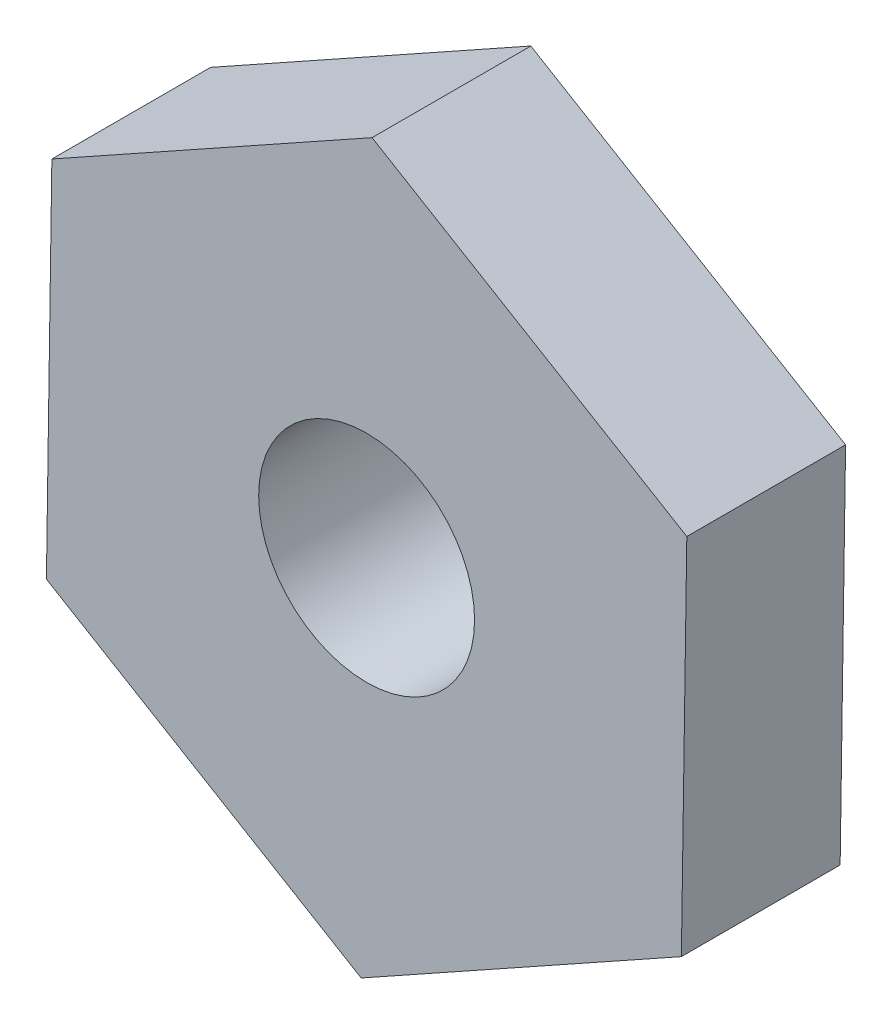
ISO-10303-21;
HEADER;
FILE_DESCRIPTION(('STEP AP214'),'2;1');
FILE_NAME('part.step','',(''),(''),'','','');
FILE_SCHEMA(('AUTOMOTIVE_DESIGN { 1 0 10303 214 1 1 1 1 }'));
ENDSEC;
DATA;
#1=APPLICATION_CONTEXT('core data for automotive mechanical design processes');
#2=APPLICATION_PROTOCOL_DEFINITION('international standard','automotive_design',2000,#1);
#3=PRODUCT_CONTEXT('',#1,'mechanical');
#4=PRODUCT('Part','Part','',(#3));
#5=PRODUCT_RELATED_PRODUCT_CATEGORY('part','',(#4));
#6=PRODUCT_DEFINITION_FORMATION('','',#4);
#7=PRODUCT_DEFINITION_CONTEXT('part definition',#1,'design');
#8=PRODUCT_DEFINITION('design','',#6,#7);
#9=PRODUCT_DEFINITION_SHAPE('','',#8);
#10=(LENGTH_UNIT() NAMED_UNIT(*) SI_UNIT(.MILLI.,.METRE.));
#11=(NAMED_UNIT(*) PLANE_ANGLE_UNIT() SI_UNIT($,.RADIAN.));
#12=(NAMED_UNIT(*) SI_UNIT($,.STERADIAN.) SOLID_ANGLE_UNIT());
#13=UNCERTAINTY_MEASURE_WITH_UNIT(LENGTH_MEASURE(1.E-05),#10,'distance_accuracy_value','');
#14=(GEOMETRIC_REPRESENTATION_CONTEXT(3) GLOBAL_UNCERTAINTY_ASSIGNED_CONTEXT((#13)) GLOBAL_UNIT_ASSIGNED_CONTEXT((#10,
#11,#12)) REPRESENTATION_CONTEXT('',''));
#15=CARTESIAN_POINT('',(0.,0.,0.));
#16=DIRECTION('',(0.,0.,1.));
#17=DIRECTION('',(1.,0.,0.));
#18=AXIS2_PLACEMENT_3D('',#15,#16,#17);
#19=CARTESIAN_POINT('',(-0.171277687011829,-11.5457350258554,5.));
#20=DIRECTION('',(-0.487099165361843,0.873346668341842,0.));
#21=DIRECTION('',(-0.873346668341842,-0.487099165361843,0.));
#22=AXIS2_PLACEMENT_3D('',#19,#20,#21);
#23=PLANE('',#22);
#24=DIRECTION('',(0.873346668341842,0.487099165361843,0.));
#25=VECTOR('',#24,1.);
#26=CARTESIAN_POINT('',(-0.171277687011829,-11.5457350258554,0.));
#27=LINE('',#26,#25);
#28=CARTESIAN_POINT('',(-0.171277687011829,-11.5457350258554,0.));
#29=VERTEX_POINT('',#28);
#30=CARTESIAN_POINT('',(9.91326099424868,-5.9211983409814,0.));
#31=VERTEX_POINT('',#30);
#32=EDGE_CURVE('E119',#29,#31,#27,.T.);
#33=ORIENTED_EDGE('',*,*,#32,.T.);
#34=DIRECTION('',(0.,0.,-1.));
#35=VECTOR('',#34,1.);
#36=CARTESIAN_POINT('',(9.91326099424868,-5.9211983409814,5.));
#37=LINE('',#36,#35);
#38=CARTESIAN_POINT('',(9.91326099424868,-5.9211983409814,5.));
#39=VERTEX_POINT('',#38);
#40=EDGE_CURVE('E11',#39,#31,#37,.T.);
#41=ORIENTED_EDGE('',*,*,#40,.F.);
#42=DIRECTION('',(0.873346668341842,0.487099165361843,0.));
#43=VECTOR('',#42,1.);
#44=CARTESIAN_POINT('',(-0.171277687011829,-11.5457350258554,5.));
#45=LINE('',#44,#43);
#46=CARTESIAN_POINT('',(-0.171277687011829,-11.5457350258554,5.));
#47=VERTEX_POINT('',#46);
#48=EDGE_CURVE('E130',#47,#39,#45,.T.);
#49=ORIENTED_EDGE('',*,*,#48,.F.);
#50=DIRECTION('',(0.,0.,-1.));
#51=VECTOR('',#50,1.);
#52=CARTESIAN_POINT('',(-0.171277687011829,-11.5457350258554,5.));
#53=LINE('',#52,#51);
#54=EDGE_CURVE('E115',#47,#29,#53,.T.);
#55=ORIENTED_EDGE('',*,*,#54,.T.);
#56=EDGE_LOOP('',(#33,#41,#49,#55));
#57=FACE_BOUND('',#56,.T.);
#58=ADVANCED_FACE('F35',(#57),#23,.F.);
#59=CARTESIAN_POINT('',(9.91326099424868,-5.9211983409814,5.));
#60=DIRECTION('',(-0.99988998377546,0.0148330828053681,0.));
#61=DIRECTION('',(-0.0148330828053681,-0.99988998377546,0.));
#62=AXIS2_PLACEMENT_3D('',#59,#60,#61);
#63=PLANE('',#62);
#64=DIRECTION('',(0.0148330828053681,0.99988998377546,0.));
#65=VECTOR('',#64,1.);
#66=CARTESIAN_POINT('',(9.91326099424868,-5.9211983409814,0.));
#67=LINE('',#66,#65);
#68=CARTESIAN_POINT('',(10.0845386812605,5.62453668487404,0.));
#69=VERTEX_POINT('',#68);
#70=EDGE_CURVE('E122',#31,#69,#67,.T.);
#71=ORIENTED_EDGE('',*,*,#70,.T.);
#72=DIRECTION('',(0.,0.,-1.));
#73=VECTOR('',#72,1.);
#74=CARTESIAN_POINT('',(10.0845386812605,5.62453668487404,5.));
#75=LINE('',#74,#73);
#76=CARTESIAN_POINT('',(10.0845386812605,5.62453668487404,5.));
#77=VERTEX_POINT('',#76);
#78=EDGE_CURVE('E43',#77,#69,#75,.T.);
#79=ORIENTED_EDGE('',*,*,#78,.F.);
#80=DIRECTION('',(0.0148330828053681,0.99988998377546,0.));
#81=VECTOR('',#80,1.);
#82=CARTESIAN_POINT('',(9.91326099424868,-5.9211983409814,5.));
#83=LINE('',#82,#81);
#84=EDGE_CURVE('E88',#39,#77,#83,.T.);
#85=ORIENTED_EDGE('',*,*,#84,.F.);
#86=ORIENTED_EDGE('',*,*,#40,.T.);
#87=EDGE_LOOP('',(#71,#79,#85,#86));
#88=FACE_BOUND('',#87,.T.);
#89=ADVANCED_FACE('F155',(#88),#63,.F.);
#90=CARTESIAN_POINT('',(10.0845386812605,5.62453668487404,5.));
#91=DIRECTION('',(-0.512790818413617,-0.858513585536474,0.));
#92=DIRECTION('',(0.858513585536474,-0.512790818413617,0.));
#93=AXIS2_PLACEMENT_3D('',#90,#91,#92);
#94=PLANE('',#93);
#95=DIRECTION('',(-0.858513585536474,0.512790818413617,0.));
#96=VECTOR('',#95,1.);
#97=CARTESIAN_POINT('',(10.0845386812605,5.62453668487404,0.));
#98=LINE('',#97,#96);
#99=CARTESIAN_POINT('',(0.17127768701183,11.5457350258554,0.));
#100=VERTEX_POINT('',#99);
#101=EDGE_CURVE('E125',#69,#100,#98,.T.);
#102=ORIENTED_EDGE('',*,*,#101,.T.);
#103=DIRECTION('',(0.,0.,-1.));
#104=VECTOR('',#103,1.);
#105=CARTESIAN_POINT('',(0.17127768701183,11.5457350258554,5.));
#106=LINE('',#105,#104);
#107=CARTESIAN_POINT('',(0.17127768701183,11.5457350258554,5.));
#108=VERTEX_POINT('',#107);
#109=EDGE_CURVE('E110',#108,#100,#106,.T.);
#110=ORIENTED_EDGE('',*,*,#109,.F.);
#111=DIRECTION('',(-0.858513585536474,0.512790818413617,0.));
#112=VECTOR('',#111,1.);
#113=CARTESIAN_POINT('',(10.0845386812605,5.62453668487404,5.));
#114=LINE('',#113,#112);
#115=EDGE_CURVE('E101',#77,#108,#114,.T.);
#116=ORIENTED_EDGE('',*,*,#115,.F.);
#117=ORIENTED_EDGE('',*,*,#78,.T.);
#118=EDGE_LOOP('',(#102,#110,#116,#117));
#119=FACE_BOUND('',#118,.T.);
#120=ADVANCED_FACE('F136',(#119),#94,.F.);
#121=CARTESIAN_POINT('',(0.17127768701183,11.5457350258554,5.));
#122=DIRECTION('',(0.487099165361843,-0.873346668341842,0.));
#123=DIRECTION('',(0.873346668341843,0.487099165361843,0.));
#124=AXIS2_PLACEMENT_3D('',#121,#122,#123);
#125=PLANE('',#124);
#126=DIRECTION('',(-0.873346668341842,-0.487099165361843,0.));
#127=VECTOR('',#126,1.);
#128=CARTESIAN_POINT('',(0.17127768701183,11.5457350258554,0.));
#129=LINE('',#128,#127);
#130=CARTESIAN_POINT('',(-9.91326099424868,5.9211983409814,0.));
#131=VERTEX_POINT('',#130);
#132=EDGE_CURVE('E109',#100,#131,#129,.T.);
#133=ORIENTED_EDGE('',*,*,#132,.T.);
#134=DIRECTION('',(0.,0.,-1.));
#135=VECTOR('',#134,1.);
#136=CARTESIAN_POINT('',(-9.91326099424868,5.9211983409814,5.));
#137=LINE('',#136,#135);
#138=CARTESIAN_POINT('',(-9.91326099424868,5.9211983409814,5.));
#139=VERTEX_POINT('',#138);
#140=EDGE_CURVE('E106',#139,#131,#137,.T.);
#141=ORIENTED_EDGE('',*,*,#140,.F.);
#142=DIRECTION('',(-0.873346668341842,-0.487099165361843,0.));
#143=VECTOR('',#142,1.);
#144=CARTESIAN_POINT('',(0.17127768701183,11.5457350258554,5.));
#145=LINE('',#144,#143);
#146=EDGE_CURVE('E95',#108,#139,#145,.T.);
#147=ORIENTED_EDGE('',*,*,#146,.F.);
#148=ORIENTED_EDGE('',*,*,#109,.T.);
#149=EDGE_LOOP('',(#133,#141,#147,#148));
#150=FACE_BOUND('',#149,.T.);
#151=ADVANCED_FACE('F107',(#150),#125,.F.);
#152=CARTESIAN_POINT('',(-9.91326099424868,5.9211983409814,5.));
#153=DIRECTION('',(0.99988998377546,-0.0148330828053684,0.));
#154=DIRECTION('',(0.0148330828053684,0.99988998377546,0.));
#155=AXIS2_PLACEMENT_3D('',#152,#153,#154);
#156=PLANE('',#155);
#157=DIRECTION('',(-0.0148330828053684,-0.99988998377546,0.));
#158=VECTOR('',#157,1.);
#159=CARTESIAN_POINT('',(-9.91326099424868,5.9211983409814,0.));
#160=LINE('',#159,#158);
#161=CARTESIAN_POINT('',(-10.0845386812605,-5.62453668487404,0.));
#162=VERTEX_POINT('',#161);
#163=EDGE_CURVE('E74',#131,#162,#160,.T.);
#164=ORIENTED_EDGE('',*,*,#163,.T.);
#165=DIRECTION('',(0.,0.,-1.));
#166=VECTOR('',#165,1.);
#167=CARTESIAN_POINT('',(-10.0845386812605,-5.62453668487404,5.));
#168=LINE('',#167,#166);
#169=CARTESIAN_POINT('',(-10.0845386812605,-5.62453668487404,5.));
#170=VERTEX_POINT('',#169);
#171=EDGE_CURVE('E111',#170,#162,#168,.T.);
#172=ORIENTED_EDGE('',*,*,#171,.F.);
#173=DIRECTION('',(-0.0148330828053684,-0.99988998377546,0.));
#174=VECTOR('',#173,1.);
#175=CARTESIAN_POINT('',(-9.91326099424868,5.9211983409814,5.));
#176=LINE('',#175,#174);
#177=EDGE_CURVE('E99',#139,#170,#176,.T.);
#178=ORIENTED_EDGE('',*,*,#177,.F.);
#179=ORIENTED_EDGE('',*,*,#140,.T.);
#180=EDGE_LOOP('',(#164,#172,#178,#179));
#181=FACE_BOUND('',#180,.T.);
#182=ADVANCED_FACE('F113',(#181),#156,.F.);
#183=CARTESIAN_POINT('',(-10.0845386812605,-5.62453668487404,5.));
#184=DIRECTION('',(0.512790818413617,0.858513585536474,0.));
#185=DIRECTION('',(-0.858513585536474,0.512790818413617,0.));
#186=AXIS2_PLACEMENT_3D('',#183,#184,#185);
#187=PLANE('',#186);
#188=DIRECTION('',(0.858513585536474,-0.512790818413617,0.));
#189=VECTOR('',#188,1.);
#190=CARTESIAN_POINT('',(-10.0845386812605,-5.62453668487404,0.));
#191=LINE('',#190,#189);
#192=EDGE_CURVE('E80',#162,#29,#191,.T.);
#193=ORIENTED_EDGE('',*,*,#192,.T.);
#194=ORIENTED_EDGE('',*,*,#54,.F.);
#195=DIRECTION('',(0.858513585536474,-0.512790818413617,0.));
#196=VECTOR('',#195,1.);
#197=CARTESIAN_POINT('',(-10.0845386812605,-5.62453668487404,5.));
#198=LINE('',#197,#196);
#199=EDGE_CURVE('E51',#170,#47,#198,.T.);
#200=ORIENTED_EDGE('',*,*,#199,.F.);
#201=ORIENTED_EDGE('',*,*,#171,.T.);
#202=EDGE_LOOP('',(#193,#194,#200,#201));
#203=FACE_BOUND('',#202,.T.);
#204=ADVANCED_FACE('F143',(#203),#187,.F.);
#205=CARTESIAN_POINT('',(0.,0.,5.));
#206=DIRECTION('',(0.,0.,1.));
#207=DIRECTION('',(1.,0.,0.));
#208=AXIS2_PLACEMENT_3D('',#205,#206,#207);
#209=PLANE('',#208);
#210=CARTESIAN_POINT('',(0.,0.,5.));
#211=DIRECTION('',(0.,0.,1.));
#212=DIRECTION('',(1.,0.,0.));
#213=AXIS2_PLACEMENT_3D('',#210,#211,#212);
#214=CIRCLE('',#213,3.4);
#215=CARTESIAN_POINT('',(3.4,0.,5.));
#216=VERTEX_POINT('',#215);
#217=EDGE_CURVE('E210',#216,#216,#214,.T.);
#218=ORIENTED_EDGE('',*,*,#217,.F.);
#219=EDGE_LOOP('',(#218));
#220=FACE_BOUND('',#219,.T.);
#221=ORIENTED_EDGE('',*,*,#48,.T.);
#222=ORIENTED_EDGE('',*,*,#84,.T.);
#223=ORIENTED_EDGE('',*,*,#115,.T.);
#224=ORIENTED_EDGE('',*,*,#146,.T.);
#225=ORIENTED_EDGE('',*,*,#177,.T.);
#226=ORIENTED_EDGE('',*,*,#199,.T.);
#227=EDGE_LOOP('',(#221,#222,#223,#224,#225,#226));
#228=FACE_BOUND('',#227,.T.);
#229=ADVANCED_FACE('F97',(#220,#228),#209,.T.);
#230=CARTESIAN_POINT('',(0.,0.,0.));
#231=DIRECTION('',(0.,0.,1.));
#232=DIRECTION('',(1.,0.,0.));
#233=AXIS2_PLACEMENT_3D('',#230,#231,#232);
#234=PLANE('',#233);
#235=CARTESIAN_POINT('',(0.,0.,0.));
#236=DIRECTION('',(0.,0.,1.));
#237=DIRECTION('',(1.,0.,0.));
#238=AXIS2_PLACEMENT_3D('',#235,#236,#237);
#239=CIRCLE('',#238,3.4);
#240=CARTESIAN_POINT('',(3.4,0.,0.));
#241=VERTEX_POINT('',#240);
#242=EDGE_CURVE('E123',#241,#241,#239,.T.);
#243=ORIENTED_EDGE('',*,*,#242,.T.);
#244=EDGE_LOOP('',(#243));
#245=FACE_BOUND('',#244,.T.);
#246=ORIENTED_EDGE('',*,*,#32,.F.);
#247=ORIENTED_EDGE('',*,*,#192,.F.);
#248=ORIENTED_EDGE('',*,*,#163,.F.);
#249=ORIENTED_EDGE('',*,*,#132,.F.);
#250=ORIENTED_EDGE('',*,*,#101,.F.);
#251=ORIENTED_EDGE('',*,*,#70,.F.);
#252=EDGE_LOOP('',(#246,#247,#248,#249,#250,#251));
#253=FACE_BOUND('',#252,.T.);
#254=ADVANCED_FACE('F139',(#245,#253),#234,.F.);
#255=CARTESIAN_POINT('',(0.,0.,5.));
#256=DIRECTION('',(0.,0.,1.));
#257=DIRECTION('',(1.,0.,0.));
#258=AXIS2_PLACEMENT_3D('',#255,#256,#257);
#259=CYLINDRICAL_SURFACE('',#258,3.4);
#260=ORIENTED_EDGE('',*,*,#217,.T.);
#261=EDGE_LOOP('',(#260));
#262=FACE_BOUND('',#261,.T.);
#263=ORIENTED_EDGE('',*,*,#242,.F.);
#264=EDGE_LOOP('',(#263));
#265=FACE_BOUND('',#264,.T.);
#266=ADVANCED_FACE('F192',(#262,#265),#259,.F.);
#267=CLOSED_SHELL('',(#58,#89,#120,#151,#182,#204,#229,#254,#266));
#268=MANIFOLD_SOLID_BREP('B2',#267);
#269=ADVANCED_BREP_SHAPE_REPRESENTATION('',(#18,#268),#14);
#270=SHAPE_DEFINITION_REPRESENTATION(#9,#269);
ENDSEC;
END-ISO-10303-21;
